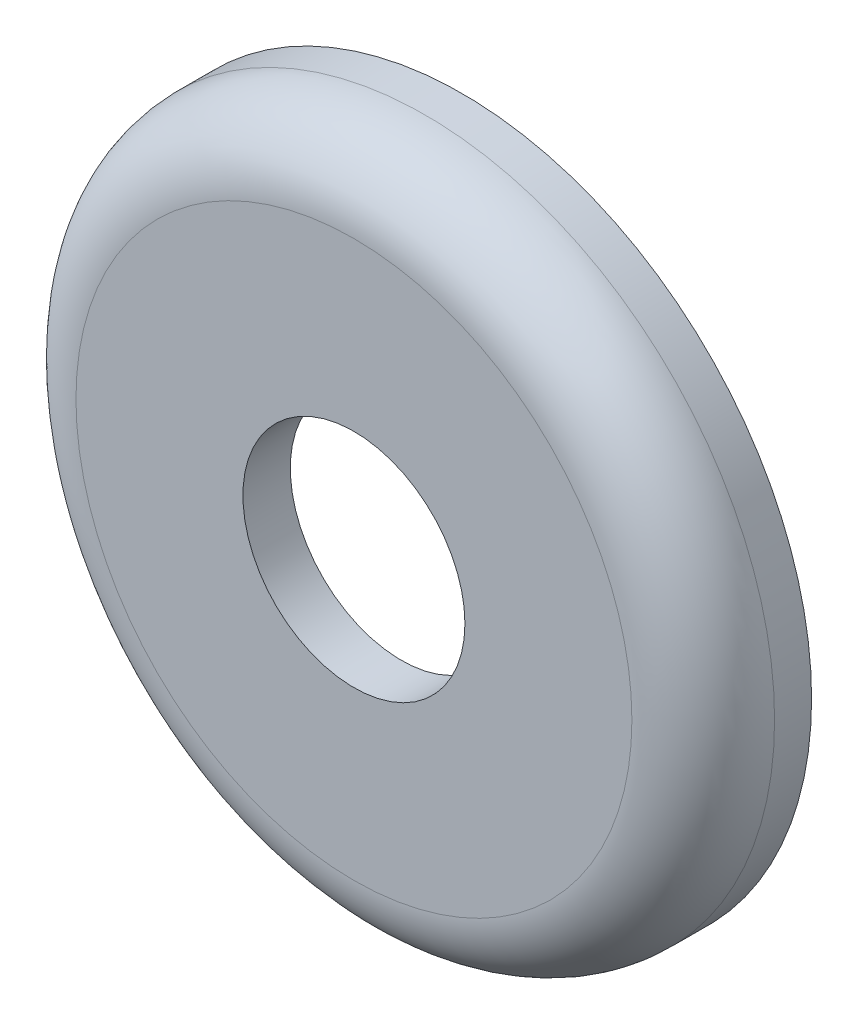
ISO-10303-21;
HEADER;
FILE_DESCRIPTION(('STEP AP214'),'2;1');
FILE_NAME('part.step','',(''),(''),'','','');
FILE_SCHEMA(('AUTOMOTIVE_DESIGN { 1 0 10303 214 1 1 1 1 }'));
ENDSEC;
DATA;
#1=APPLICATION_CONTEXT('core data for automotive mechanical design processes');
#2=APPLICATION_PROTOCOL_DEFINITION('international standard','automotive_design',2000,#1);
#3=PRODUCT_CONTEXT('',#1,'mechanical');
#4=PRODUCT('Part','Part','',(#3));
#5=PRODUCT_RELATED_PRODUCT_CATEGORY('part','',(#4));
#6=PRODUCT_DEFINITION_FORMATION('','',#4);
#7=PRODUCT_DEFINITION_CONTEXT('part definition',#1,'design');
#8=PRODUCT_DEFINITION('design','',#6,#7);
#9=PRODUCT_DEFINITION_SHAPE('','',#8);
#10=(LENGTH_UNIT() NAMED_UNIT(*) SI_UNIT(.MILLI.,.METRE.));
#11=(NAMED_UNIT(*) PLANE_ANGLE_UNIT() SI_UNIT($,.RADIAN.));
#12=(NAMED_UNIT(*) SI_UNIT($,.STERADIAN.) SOLID_ANGLE_UNIT());
#13=UNCERTAINTY_MEASURE_WITH_UNIT(LENGTH_MEASURE(1.E-05),#10,'distance_accuracy_value','');
#14=(GEOMETRIC_REPRESENTATION_CONTEXT(3) GLOBAL_UNCERTAINTY_ASSIGNED_CONTEXT((#13)) GLOBAL_UNIT_ASSIGNED_CONTEXT((#10,
#11,#12)) REPRESENTATION_CONTEXT('',''));
#15=CARTESIAN_POINT('',(0.,0.,0.));
#16=DIRECTION('',(0.,0.,1.));
#17=DIRECTION('',(1.,0.,0.));
#18=AXIS2_PLACEMENT_3D('',#15,#16,#17);
#19=CARTESIAN_POINT('',(0.,0.,-2.428875));
#20=DIRECTION('',(0.,0.,1.));
#21=DIRECTION('',(1.,0.,0.));
#22=AXIS2_PLACEMENT_3D('',#19,#20,#21);
#23=TOROIDAL_SURFACE('',#22,12.5603,0.396875);
#24=CARTESIAN_POINT('',(0.,0.,-2.35273830932899));
#25=DIRECTION('',(0.,0.,1.));
#26=DIRECTION('',(1.,0.,0.));
#27=AXIS2_PLACEMENT_3D('',#24,#25,#26);
#28=CIRCLE('',#27,12.9498034915873);
#29=CARTESIAN_POINT('',(12.9498034915873,0.,-2.35273830932899));
#30=VERTEX_POINT('',#29);
#31=EDGE_CURVE('E62',#30,#30,#28,.T.);
#32=ORIENTED_EDGE('',*,*,#31,.F.);
#33=EDGE_LOOP('',(#32));
#34=FACE_BOUND('',#33,.T.);
#35=CARTESIAN_POINT('',(0.,0.,-2.032));
#36=DIRECTION('',(0.,0.,1.));
#37=DIRECTION('',(1.,0.,0.));
#38=AXIS2_PLACEMENT_3D('',#35,#36,#37);
#39=CIRCLE('',#38,12.5603);
#40=CARTESIAN_POINT('',(12.5603,0.,-2.032));
#41=VERTEX_POINT('',#40);
#42=EDGE_CURVE('E10',#41,#41,#39,.T.);
#43=ORIENTED_EDGE('',*,*,#42,.T.);
#44=EDGE_LOOP('',(#43));
#45=FACE_BOUND('',#44,.T.);
#46=ADVANCED_FACE('F34',(#34,#45),#23,.F.);
#47=CARTESIAN_POINT('',(0.,0.,-2.032));
#48=DIRECTION('',(0.,0.,1.));
#49=DIRECTION('',(1.,0.,0.));
#50=AXIS2_PLACEMENT_3D('',#47,#48,#49);
#51=PLANE('',#50);
#52=ORIENTED_EDGE('',*,*,#42,.F.);
#53=EDGE_LOOP('',(#52));
#54=FACE_BOUND('',#53,.T.);
#55=CARTESIAN_POINT('',(0.,0.,-2.032));
#56=DIRECTION('',(0.,0.,1.));
#57=DIRECTION('',(1.,0.,0.));
#58=AXIS2_PLACEMENT_3D('',#55,#56,#57);
#59=CIRCLE('',#58,4.7625);
#60=CARTESIAN_POINT('',(4.7625,0.,-2.032));
#61=VERTEX_POINT('',#60);
#62=EDGE_CURVE('E40',#61,#61,#59,.T.);
#63=ORIENTED_EDGE('',*,*,#62,.T.);
#64=EDGE_LOOP('',(#63));
#65=FACE_BOUND('',#64,.T.);
#66=ADVANCED_FACE('F70',(#54,#65),#51,.F.);
#67=CARTESIAN_POINT('',(0.,0.,0.));
#68=DIRECTION('',(0.,0.,1.));
#69=DIRECTION('',(1.,0.,0.));
#70=AXIS2_PLACEMENT_3D('',#67,#68,#69);
#71=CYLINDRICAL_SURFACE('',#70,4.7625);
#72=CARTESIAN_POINT('',(0.,0.,0.));
#73=DIRECTION('',(0.,0.,1.));
#74=DIRECTION('',(1.,0.,0.));
#75=AXIS2_PLACEMENT_3D('',#72,#73,#74);
#76=CIRCLE('',#75,4.7625);
#77=CARTESIAN_POINT('',(4.7625,0.,0.));
#78=VERTEX_POINT('',#77);
#79=EDGE_CURVE('E44',#78,#78,#76,.T.);
#80=ORIENTED_EDGE('',*,*,#79,.T.);
#81=EDGE_LOOP('',(#80));
#82=FACE_BOUND('',#81,.T.);
#83=ORIENTED_EDGE('',*,*,#62,.F.);
#84=EDGE_LOOP('',(#83));
#85=FACE_BOUND('',#84,.T.);
#86=ADVANCED_FACE('F74',(#82,#85),#71,.F.);
#87=CARTESIAN_POINT('',(0.,0.,0.));
#88=DIRECTION('',(0.,0.,1.));
#89=DIRECTION('',(1.,0.,0.));
#90=AXIS2_PLACEMENT_3D('',#87,#88,#89);
#91=PLANE('',#90);
#92=CARTESIAN_POINT('',(0.,0.,0.));
#93=DIRECTION('',(0.,0.,1.));
#94=DIRECTION('',(1.,0.,0.));
#95=AXIS2_PLACEMENT_3D('',#92,#93,#94);
#96=CIRCLE('',#95,11.9253);
#97=CARTESIAN_POINT('',(11.9253,0.,0.));
#98=VERTEX_POINT('',#97);
#99=EDGE_CURVE('E48',#98,#98,#96,.T.);
#100=ORIENTED_EDGE('',*,*,#99,.T.);
#101=EDGE_LOOP('',(#100));
#102=FACE_BOUND('',#101,.T.);
#103=ORIENTED_EDGE('',*,*,#79,.F.);
#104=EDGE_LOOP('',(#103));
#105=FACE_BOUND('',#104,.T.);
#106=ADVANCED_FACE('F79',(#102,#105),#91,.T.);
#107=CARTESIAN_POINT('',(0.,0.,-3.0607));
#108=DIRECTION('',(0.,0.,1.));
#109=DIRECTION('',(1.,0.,0.));
#110=AXIS2_PLACEMENT_3D('',#107,#108,#109);
#111=TOROIDAL_SURFACE('',#110,11.9253,3.0607);
#112=CARTESIAN_POINT('',(0.,0.,-3.0607));
#113=DIRECTION('',(0.,0.,1.));
#114=DIRECTION('',(1.,0.,0.));
#115=AXIS2_PLACEMENT_3D('',#112,#113,#114);
#116=CIRCLE('',#115,14.986);
#117=CARTESIAN_POINT('',(14.986,0.,-3.0607));
#118=VERTEX_POINT('',#117);
#119=EDGE_CURVE('E53',#118,#118,#116,.T.);
#120=ORIENTED_EDGE('',*,*,#119,.T.);
#121=EDGE_LOOP('',(#120));
#122=FACE_BOUND('',#121,.T.);
#123=ORIENTED_EDGE('',*,*,#99,.F.);
#124=EDGE_LOOP('',(#123));
#125=FACE_BOUND('',#124,.T.);
#126=ADVANCED_FACE('F85',(#122,#125),#111,.T.);
#127=CARTESIAN_POINT('',(0.,0.,0.));
#128=DIRECTION('',(0.,0.,1.));
#129=DIRECTION('',(1.,0.,0.));
#130=AXIS2_PLACEMENT_3D('',#127,#128,#129);
#131=CYLINDRICAL_SURFACE('',#130,14.986);
#132=CARTESIAN_POINT('',(0.,0.,-4.6482));
#133=DIRECTION('',(0.,0.,1.));
#134=DIRECTION('',(1.,0.,0.));
#135=AXIS2_PLACEMENT_3D('',#132,#133,#134);
#136=CIRCLE('',#135,14.986);
#137=CARTESIAN_POINT('',(14.986,0.,-4.6482));
#138=VERTEX_POINT('',#137);
#139=EDGE_CURVE('E56',#138,#138,#136,.T.);
#140=ORIENTED_EDGE('',*,*,#139,.T.);
#141=EDGE_LOOP('',(#140));
#142=FACE_BOUND('',#141,.T.);
#143=ORIENTED_EDGE('',*,*,#119,.F.);
#144=EDGE_LOOP('',(#143));
#145=FACE_BOUND('',#144,.T.);
#146=ADVANCED_FACE('F89',(#142,#145),#131,.T.);
#147=CARTESIAN_POINT('',(0.,0.,-4.6482));
#148=DIRECTION('',(0.,0.,-1.));
#149=DIRECTION('',(-1.,0.,0.));
#150=AXIS2_PLACEMENT_3D('',#147,#148,#149);
#151=PLANE('',#150);
#152=CARTESIAN_POINT('',(0.,0.,-4.6482));
#153=DIRECTION('',(0.,0.,1.));
#154=DIRECTION('',(1.,0.,0.));
#155=AXIS2_PLACEMENT_3D('',#152,#153,#154);
#156=CIRCLE('',#155,13.3985);
#157=CARTESIAN_POINT('',(13.3985,0.,-4.6482));
#158=VERTEX_POINT('',#157);
#159=EDGE_CURVE('E59',#158,#158,#156,.T.);
#160=ORIENTED_EDGE('',*,*,#159,.T.);
#161=EDGE_LOOP('',(#160));
#162=FACE_BOUND('',#161,.T.);
#163=ORIENTED_EDGE('',*,*,#139,.F.);
#164=EDGE_LOOP('',(#163));
#165=FACE_BOUND('',#164,.T.);
#166=ADVANCED_FACE('F93',(#162,#165),#151,.T.);
#167=CARTESIAN_POINT('',(0.,0.,-4.6482));
#168=DIRECTION('',(0.,0.,-1.));
#169=DIRECTION('',(-1.,0.,0.));
#170=AXIS2_PLACEMENT_3D('',#167,#168,#169);
#171=CONICAL_SURFACE('',#170,13.3985,0.193037116293885);
#172=ORIENTED_EDGE('',*,*,#31,.T.);
#173=EDGE_LOOP('',(#172));
#174=FACE_BOUND('',#173,.T.);
#175=ORIENTED_EDGE('',*,*,#159,.F.);
#176=EDGE_LOOP('',(#175));
#177=FACE_BOUND('',#176,.T.);
#178=ADVANCED_FACE('F66',(#174,#177),#171,.F.);
#179=CLOSED_SHELL('',(#46,#66,#86,#106,#126,#146,#166,#178));
#180=MANIFOLD_SOLID_BREP('B2',#179);
#181=ADVANCED_BREP_SHAPE_REPRESENTATION('',(#18,#180),#14);
#182=SHAPE_DEFINITION_REPRESENTATION(#9,#181);
ENDSEC;
END-ISO-10303-21;
